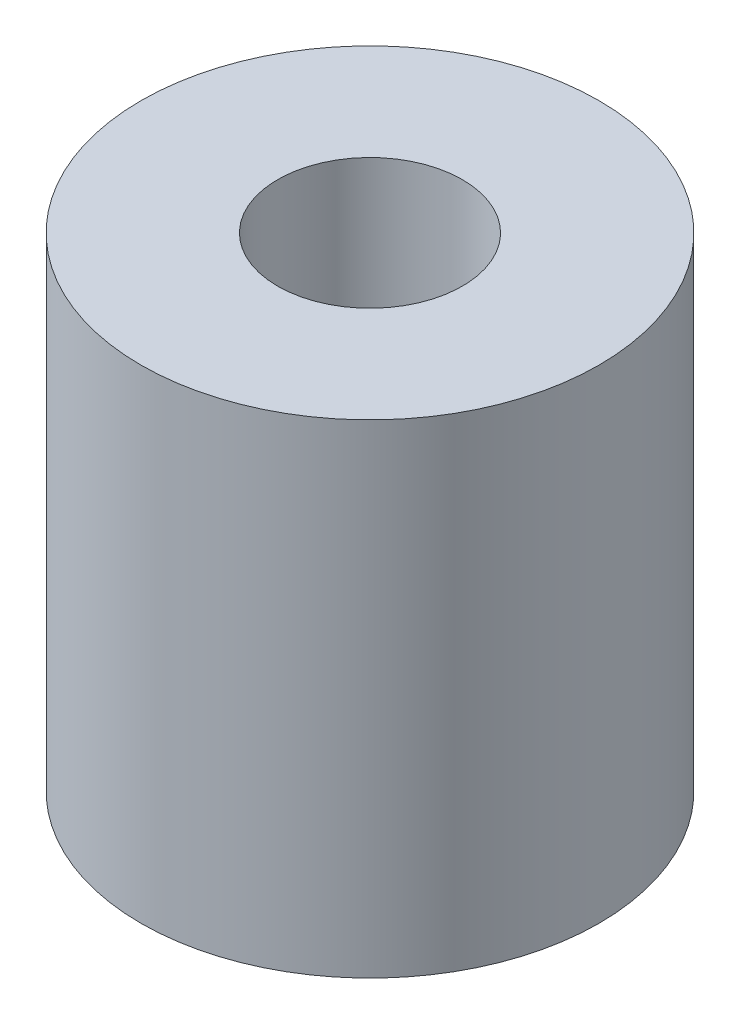
ISO-10303-21;
HEADER;
FILE_DESCRIPTION(('STEP AP214'),'2;1');
FILE_NAME('part.step','',(''),(''),'','','');
FILE_SCHEMA(('AUTOMOTIVE_DESIGN { 1 0 10303 214 1 1 1 1 }'));
ENDSEC;
DATA;
#1=APPLICATION_CONTEXT('core data for automotive mechanical design processes');
#2=APPLICATION_PROTOCOL_DEFINITION('international standard','automotive_design',2000,#1);
#3=PRODUCT_CONTEXT('',#1,'mechanical');
#4=PRODUCT('Part','Part','',(#3));
#5=PRODUCT_RELATED_PRODUCT_CATEGORY('part','',(#4));
#6=PRODUCT_DEFINITION_FORMATION('','',#4);
#7=PRODUCT_DEFINITION_CONTEXT('part definition',#1,'design');
#8=PRODUCT_DEFINITION('design','',#6,#7);
#9=PRODUCT_DEFINITION_SHAPE('','',#8);
#10=(LENGTH_UNIT() NAMED_UNIT(*) SI_UNIT(.MILLI.,.METRE.));
#11=(NAMED_UNIT(*) PLANE_ANGLE_UNIT() SI_UNIT($,.RADIAN.));
#12=(NAMED_UNIT(*) SI_UNIT($,.STERADIAN.) SOLID_ANGLE_UNIT());
#13=UNCERTAINTY_MEASURE_WITH_UNIT(LENGTH_MEASURE(1.E-05),#10,'distance_accuracy_value','');
#14=(GEOMETRIC_REPRESENTATION_CONTEXT(3) GLOBAL_UNCERTAINTY_ASSIGNED_CONTEXT((#13)) GLOBAL_UNIT_ASSIGNED_CONTEXT((#10,
#11,#12)) REPRESENTATION_CONTEXT('',''));
#15=CARTESIAN_POINT('',(0.,0.,0.));
#16=DIRECTION('',(0.,0.,1.));
#17=DIRECTION('',(1.,0.,0.));
#18=AXIS2_PLACEMENT_3D('',#15,#16,#17);
#19=CARTESIAN_POINT('',(0.,16.755,0.));
#20=DIRECTION('',(0.,1.,0.));
#21=DIRECTION('',(0.,0.,1.));
#22=AXIS2_PLACEMENT_3D('',#19,#20,#21);
#23=PLANE('',#22);
#24=CARTESIAN_POINT('',(0.,16.755,0.));
#25=DIRECTION('',(0.,1.,0.));
#26=DIRECTION('',(0.,0.,1.));
#27=AXIS2_PLACEMENT_3D('',#24,#25,#26);
#28=CIRCLE('',#27,7.9375);
#29=CARTESIAN_POINT('',(0.,16.755,7.9375));
#30=VERTEX_POINT('',#29);
#31=EDGE_CURVE('E10',#30,#30,#28,.T.);
#32=ORIENTED_EDGE('',*,*,#31,.T.);
#33=EDGE_LOOP('',(#32));
#34=FACE_BOUND('',#33,.T.);
#35=CARTESIAN_POINT('',(0.,16.755,0.));
#36=DIRECTION('',(0.,1.,0.));
#37=DIRECTION('',(0.,0.,1.));
#38=AXIS2_PLACEMENT_3D('',#35,#36,#37);
#39=CIRCLE('',#38,3.2004);
#40=CARTESIAN_POINT('',(0.,16.755,3.2004));
#41=VERTEX_POINT('',#40);
#42=EDGE_CURVE('E44',#41,#41,#39,.T.);
#43=ORIENTED_EDGE('',*,*,#42,.F.);
#44=EDGE_LOOP('',(#43));
#45=FACE_BOUND('',#44,.T.);
#46=ADVANCED_FACE('F33',(#34,#45),#23,.T.);
#47=CARTESIAN_POINT('',(0.,0.,0.));
#48=DIRECTION('',(0.,1.,0.));
#49=DIRECTION('',(0.,0.,1.));
#50=AXIS2_PLACEMENT_3D('',#47,#48,#49);
#51=PLANE('',#50);
#52=CARTESIAN_POINT('',(0.,0.,0.));
#53=DIRECTION('',(0.,1.,0.));
#54=DIRECTION('',(0.,0.,1.));
#55=AXIS2_PLACEMENT_3D('',#52,#53,#54);
#56=CIRCLE('',#55,7.9375);
#57=CARTESIAN_POINT('',(0.,0.,7.9375));
#58=VERTEX_POINT('',#57);
#59=EDGE_CURVE('E37',#58,#58,#56,.T.);
#60=ORIENTED_EDGE('',*,*,#59,.F.);
#61=EDGE_LOOP('',(#60));
#62=FACE_BOUND('',#61,.T.);
#63=CARTESIAN_POINT('',(0.,0.,0.));
#64=DIRECTION('',(0.,1.,0.));
#65=DIRECTION('',(0.,0.,1.));
#66=AXIS2_PLACEMENT_3D('',#63,#64,#65);
#67=CIRCLE('',#66,3.2004);
#68=CARTESIAN_POINT('',(0.,0.,3.2004));
#69=VERTEX_POINT('',#68);
#70=EDGE_CURVE('E46',#69,#69,#67,.T.);
#71=ORIENTED_EDGE('',*,*,#70,.T.);
#72=EDGE_LOOP('',(#71));
#73=FACE_BOUND('',#72,.T.);
#74=ADVANCED_FACE('F56',(#62,#73),#51,.F.);
#75=CARTESIAN_POINT('',(0.,16.755,0.));
#76=DIRECTION('',(0.,-1.,0.));
#77=DIRECTION('',(0.,0.,-1.));
#78=AXIS2_PLACEMENT_3D('',#75,#76,#77);
#79=CYLINDRICAL_SURFACE('',#78,7.9375);
#80=ORIENTED_EDGE('',*,*,#31,.F.);
#81=EDGE_LOOP('',(#80));
#82=FACE_BOUND('',#81,.T.);
#83=ORIENTED_EDGE('',*,*,#59,.T.);
#84=EDGE_LOOP('',(#83));
#85=FACE_BOUND('',#84,.T.);
#86=ADVANCED_FACE('F35',(#82,#85),#79,.T.);
#87=CARTESIAN_POINT('',(0.,16.755,0.));
#88=DIRECTION('',(0.,-1.,0.));
#89=DIRECTION('',(0.,0.,-1.));
#90=AXIS2_PLACEMENT_3D('',#87,#88,#89);
#91=CYLINDRICAL_SURFACE('',#90,3.2004);
#92=ORIENTED_EDGE('',*,*,#42,.T.);
#93=EDGE_LOOP('',(#92));
#94=FACE_BOUND('',#93,.T.);
#95=ORIENTED_EDGE('',*,*,#70,.F.);
#96=EDGE_LOOP('',(#95));
#97=FACE_BOUND('',#96,.T.);
#98=ADVANCED_FACE('F52',(#94,#97),#91,.F.);
#99=CLOSED_SHELL('',(#46,#74,#86,#98));
#100=MANIFOLD_SOLID_BREP('B2',#99);
#101=ADVANCED_BREP_SHAPE_REPRESENTATION('',(#18,#100),#14);
#102=SHAPE_DEFINITION_REPRESENTATION(#9,#101);
ENDSEC;
END-ISO-10303-21;
